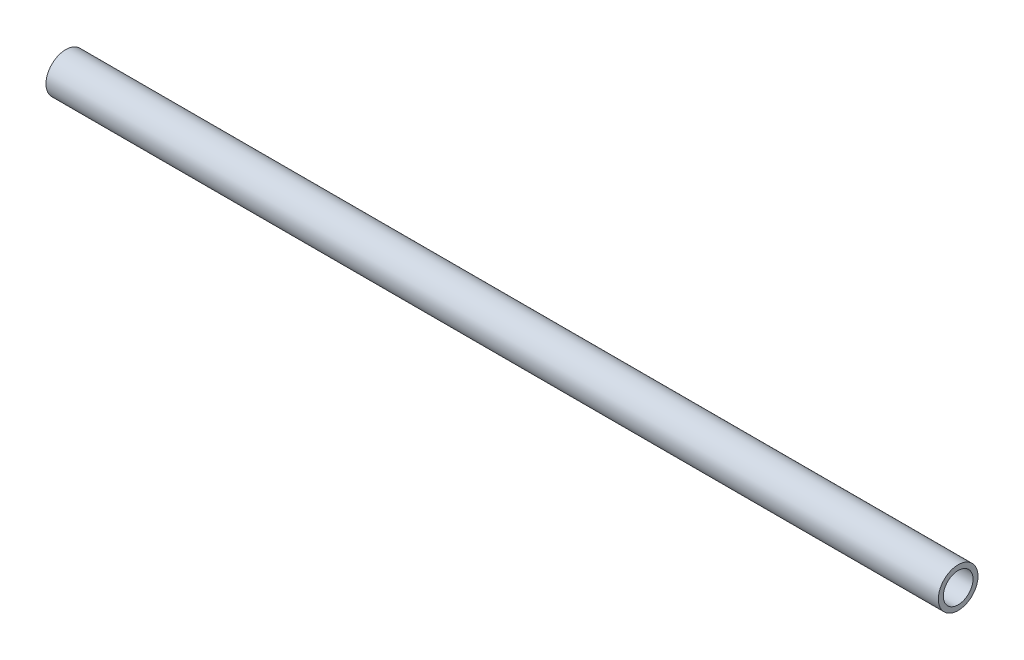
ISO-10303-21;
HEADER;
FILE_DESCRIPTION(('STEP AP214'),'2;1');
FILE_NAME('part.step','',(''),(''),'','','');
FILE_SCHEMA(('AUTOMOTIVE_DESIGN { 1 0 10303 214 1 1 1 1 }'));
ENDSEC;
DATA;
#1=APPLICATION_CONTEXT('core data for automotive mechanical design processes');
#2=APPLICATION_PROTOCOL_DEFINITION('international standard','automotive_design',2000,#1);
#3=PRODUCT_CONTEXT('',#1,'mechanical');
#4=PRODUCT('Part','Part','',(#3));
#5=PRODUCT_RELATED_PRODUCT_CATEGORY('part','',(#4));
#6=PRODUCT_DEFINITION_FORMATION('','',#4);
#7=PRODUCT_DEFINITION_CONTEXT('part definition',#1,'design');
#8=PRODUCT_DEFINITION('design','',#6,#7);
#9=PRODUCT_DEFINITION_SHAPE('','',#8);
#10=(LENGTH_UNIT() NAMED_UNIT(*) SI_UNIT(.MILLI.,.METRE.));
#11=(NAMED_UNIT(*) PLANE_ANGLE_UNIT() SI_UNIT($,.RADIAN.));
#12=(NAMED_UNIT(*) SI_UNIT($,.STERADIAN.) SOLID_ANGLE_UNIT());
#13=UNCERTAINTY_MEASURE_WITH_UNIT(LENGTH_MEASURE(1.E-05),#10,'distance_accuracy_value','');
#14=(GEOMETRIC_REPRESENTATION_CONTEXT(3) GLOBAL_UNCERTAINTY_ASSIGNED_CONTEXT((#13)) GLOBAL_UNIT_ASSIGNED_CONTEXT((#10,
#11,#12)) REPRESENTATION_CONTEXT('',''));
#15=CARTESIAN_POINT('',(0.,0.,0.));
#16=DIRECTION('',(0.,0.,1.));
#17=DIRECTION('',(1.,0.,0.));
#18=AXIS2_PLACEMENT_3D('',#15,#16,#17);
#19=CARTESIAN_POINT('',(180.,0.,0.));
#20=DIRECTION('',(1.,0.,0.));
#21=DIRECTION('',(0.,0.,-1.));
#22=AXIS2_PLACEMENT_3D('',#19,#20,#21);
#23=PLANE('',#22);
#24=CARTESIAN_POINT('',(180.,0.,0.));
#25=DIRECTION('',(1.,0.,0.));
#26=DIRECTION('',(0.,0.,-1.));
#27=AXIS2_PLACEMENT_3D('',#24,#25,#26);
#28=CIRCLE('',#27,8.);
#29=CARTESIAN_POINT('',(180.,0.,-8.));
#30=VERTEX_POINT('',#29);
#31=EDGE_CURVE('E10',#30,#30,#28,.T.);
#32=ORIENTED_EDGE('',*,*,#31,.T.);
#33=EDGE_LOOP('',(#32));
#34=FACE_BOUND('',#33,.T.);
#35=CARTESIAN_POINT('',(180.,0.,0.));
#36=DIRECTION('',(1.,0.,0.));
#37=DIRECTION('',(0.,0.,-1.));
#38=AXIS2_PLACEMENT_3D('',#35,#36,#37);
#39=CIRCLE('',#38,6.);
#40=CARTESIAN_POINT('',(180.,0.,-6.));
#41=VERTEX_POINT('',#40);
#42=EDGE_CURVE('E50',#41,#41,#39,.T.);
#43=ORIENTED_EDGE('',*,*,#42,.F.);
#44=EDGE_LOOP('',(#43));
#45=FACE_BOUND('',#44,.T.);
#46=ADVANCED_FACE('F39',(#34,#45),#23,.T.);
#47=CARTESIAN_POINT('',(-180.,0.,0.));
#48=DIRECTION('',(1.,0.,0.));
#49=DIRECTION('',(0.,0.,-1.));
#50=AXIS2_PLACEMENT_3D('',#47,#48,#49);
#51=PLANE('',#50);
#52=CARTESIAN_POINT('',(-180.,0.,0.));
#53=DIRECTION('',(1.,0.,0.));
#54=DIRECTION('',(0.,0.,-1.));
#55=AXIS2_PLACEMENT_3D('',#52,#53,#54);
#56=CIRCLE('',#55,8.);
#57=CARTESIAN_POINT('',(-180.,0.,-8.));
#58=VERTEX_POINT('',#57);
#59=EDGE_CURVE('E43',#58,#58,#56,.T.);
#60=ORIENTED_EDGE('',*,*,#59,.F.);
#61=EDGE_LOOP('',(#60));
#62=FACE_BOUND('',#61,.T.);
#63=CARTESIAN_POINT('',(-180.,0.,0.));
#64=DIRECTION('',(1.,0.,0.));
#65=DIRECTION('',(0.,0.,-1.));
#66=AXIS2_PLACEMENT_3D('',#63,#64,#65);
#67=CIRCLE('',#66,6.);
#68=CARTESIAN_POINT('',(-180.,0.,-6.));
#69=VERTEX_POINT('',#68);
#70=EDGE_CURVE('E52',#69,#69,#67,.T.);
#71=ORIENTED_EDGE('',*,*,#70,.T.);
#72=EDGE_LOOP('',(#71));
#73=FACE_BOUND('',#72,.T.);
#74=ADVANCED_FACE('F62',(#62,#73),#51,.F.);
#75=CARTESIAN_POINT('',(180.,0.,0.));
#76=DIRECTION('',(-1.,0.,0.));
#77=DIRECTION('',(0.,0.,1.));
#78=AXIS2_PLACEMENT_3D('',#75,#76,#77);
#79=CYLINDRICAL_SURFACE('',#78,8.);
#80=ORIENTED_EDGE('',*,*,#31,.F.);
#81=EDGE_LOOP('',(#80));
#82=FACE_BOUND('',#81,.T.);
#83=ORIENTED_EDGE('',*,*,#59,.T.);
#84=EDGE_LOOP('',(#83));
#85=FACE_BOUND('',#84,.T.);
#86=ADVANCED_FACE('F41',(#82,#85),#79,.T.);
#87=CARTESIAN_POINT('',(180.,0.,0.));
#88=DIRECTION('',(-1.,0.,0.));
#89=DIRECTION('',(0.,0.,1.));
#90=AXIS2_PLACEMENT_3D('',#87,#88,#89);
#91=CYLINDRICAL_SURFACE('',#90,6.);
#92=ORIENTED_EDGE('',*,*,#42,.T.);
#93=EDGE_LOOP('',(#92));
#94=FACE_BOUND('',#93,.T.);
#95=ORIENTED_EDGE('',*,*,#70,.F.);
#96=EDGE_LOOP('',(#95));
#97=FACE_BOUND('',#96,.T.);
#98=ADVANCED_FACE('F58',(#94,#97),#91,.F.);
#99=CLOSED_SHELL('',(#46,#74,#86,#98));
#100=MANIFOLD_SOLID_BREP('B2',#99);
#101=ADVANCED_BREP_SHAPE_REPRESENTATION('',(#18,#100),#14);
#102=SHAPE_DEFINITION_REPRESENTATION(#9,#101);
ENDSEC;
END-ISO-10303-21;
